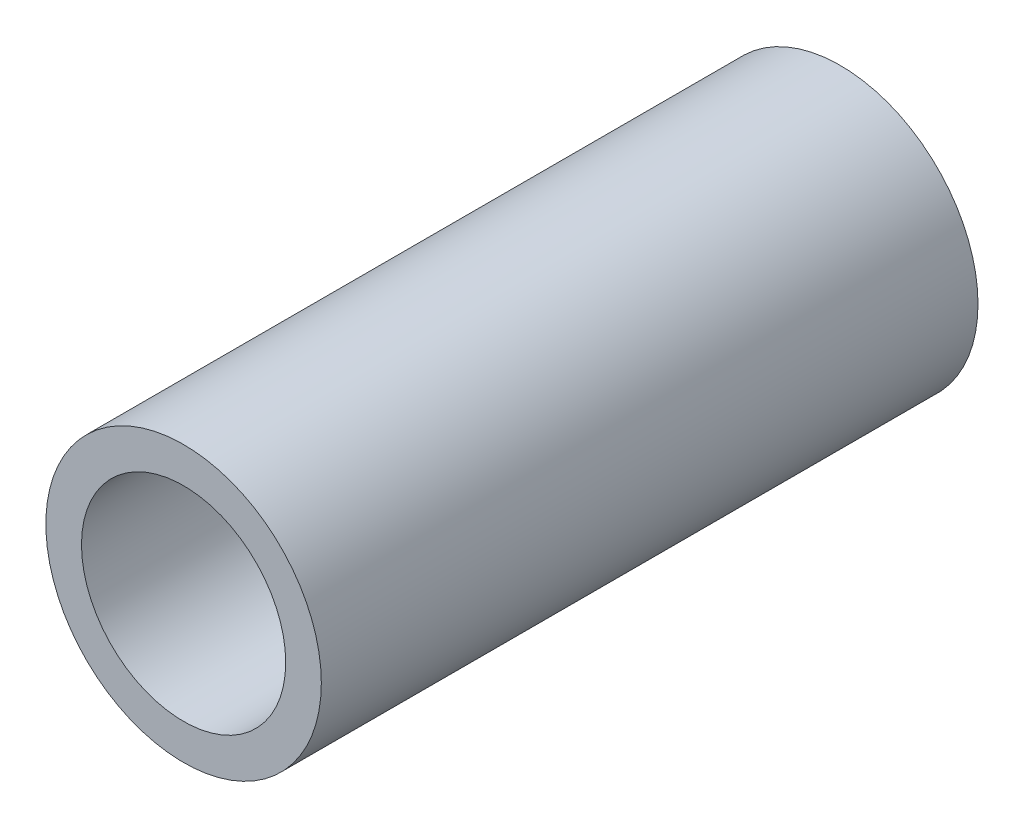
ISO-10303-21;
HEADER;
FILE_DESCRIPTION(('STEP AP214'),'2;1');
FILE_NAME('part.step','',(''),(''),'','','');
FILE_SCHEMA(('AUTOMOTIVE_DESIGN { 1 0 10303 214 1 1 1 1 }'));
ENDSEC;
DATA;
#1=APPLICATION_CONTEXT('core data for automotive mechanical design processes');
#2=APPLICATION_PROTOCOL_DEFINITION('international standard','automotive_design',2000,#1);
#3=PRODUCT_CONTEXT('',#1,'mechanical');
#4=PRODUCT('Part','Part','',(#3));
#5=PRODUCT_RELATED_PRODUCT_CATEGORY('part','',(#4));
#6=PRODUCT_DEFINITION_FORMATION('','',#4);
#7=PRODUCT_DEFINITION_CONTEXT('part definition',#1,'design');
#8=PRODUCT_DEFINITION('design','',#6,#7);
#9=PRODUCT_DEFINITION_SHAPE('','',#8);
#10=(LENGTH_UNIT() NAMED_UNIT(*) SI_UNIT(.MILLI.,.METRE.));
#11=(NAMED_UNIT(*) PLANE_ANGLE_UNIT() SI_UNIT($,.RADIAN.));
#12=(NAMED_UNIT(*) SI_UNIT($,.STERADIAN.) SOLID_ANGLE_UNIT());
#13=UNCERTAINTY_MEASURE_WITH_UNIT(LENGTH_MEASURE(1.E-05),#10,'distance_accuracy_value','');
#14=(GEOMETRIC_REPRESENTATION_CONTEXT(3) GLOBAL_UNCERTAINTY_ASSIGNED_CONTEXT((#13)) GLOBAL_UNIT_ASSIGNED_CONTEXT((#10,
#11,#12)) REPRESENTATION_CONTEXT('',''));
#15=CARTESIAN_POINT('',(0.,0.,0.));
#16=DIRECTION('',(0.,0.,1.));
#17=DIRECTION('',(1.,0.,0.));
#18=AXIS2_PLACEMENT_3D('',#15,#16,#17);
#19=CARTESIAN_POINT('',(0.,0.,50.8));
#20=DIRECTION('',(0.,0.,1.));
#21=DIRECTION('',(1.,0.,0.));
#22=AXIS2_PLACEMENT_3D('',#19,#20,#21);
#23=PLANE('',#22);
#24=CARTESIAN_POINT('',(0.,0.,50.8));
#25=DIRECTION('',(0.,0.,1.));
#26=DIRECTION('',(1.,0.,0.));
#27=AXIS2_PLACEMENT_3D('',#24,#25,#26);
#28=CIRCLE('',#27,10.6553);
#29=CARTESIAN_POINT('',(10.6553,0.,50.8));
#30=VERTEX_POINT('',#29);
#31=EDGE_CURVE('E10',#30,#30,#28,.T.);
#32=ORIENTED_EDGE('',*,*,#31,.T.);
#33=EDGE_LOOP('',(#32));
#34=FACE_BOUND('',#33,.T.);
#35=CARTESIAN_POINT('',(0.,0.,50.8));
#36=DIRECTION('',(0.,0.,1.));
#37=DIRECTION('',(1.,0.,0.));
#38=AXIS2_PLACEMENT_3D('',#35,#36,#37);
#39=CIRCLE('',#38,7.8994);
#40=CARTESIAN_POINT('',(7.8994,0.,50.8));
#41=VERTEX_POINT('',#40);
#42=EDGE_CURVE('E41',#41,#41,#39,.T.);
#43=ORIENTED_EDGE('',*,*,#42,.F.);
#44=EDGE_LOOP('',(#43));
#45=FACE_BOUND('',#44,.T.);
#46=ADVANCED_FACE('F30',(#34,#45),#23,.T.);
#47=CARTESIAN_POINT('',(0.,0.,0.));
#48=DIRECTION('',(0.,0.,1.));
#49=DIRECTION('',(1.,0.,0.));
#50=AXIS2_PLACEMENT_3D('',#47,#48,#49);
#51=PLANE('',#50);
#52=CARTESIAN_POINT('',(0.,0.,0.));
#53=DIRECTION('',(0.,0.,1.));
#54=DIRECTION('',(1.,0.,0.));
#55=AXIS2_PLACEMENT_3D('',#52,#53,#54);
#56=CIRCLE('',#55,10.6553);
#57=CARTESIAN_POINT('',(10.6553,0.,0.));
#58=VERTEX_POINT('',#57);
#59=EDGE_CURVE('E34',#58,#58,#56,.T.);
#60=ORIENTED_EDGE('',*,*,#59,.F.);
#61=EDGE_LOOP('',(#60));
#62=FACE_BOUND('',#61,.T.);
#63=CARTESIAN_POINT('',(0.,0.,0.));
#64=DIRECTION('',(0.,0.,1.));
#65=DIRECTION('',(1.,0.,0.));
#66=AXIS2_PLACEMENT_3D('',#63,#64,#65);
#67=CIRCLE('',#66,7.8994);
#68=CARTESIAN_POINT('',(7.8994,0.,0.));
#69=VERTEX_POINT('',#68);
#70=EDGE_CURVE('E43',#69,#69,#67,.T.);
#71=ORIENTED_EDGE('',*,*,#70,.T.);
#72=EDGE_LOOP('',(#71));
#73=FACE_BOUND('',#72,.T.);
#74=ADVANCED_FACE('F53',(#62,#73),#51,.F.);
#75=CARTESIAN_POINT('',(0.,0.,50.8));
#76=DIRECTION('',(0.,0.,-1.));
#77=DIRECTION('',(-1.,0.,0.));
#78=AXIS2_PLACEMENT_3D('',#75,#76,#77);
#79=CYLINDRICAL_SURFACE('',#78,10.6553);
#80=ORIENTED_EDGE('',*,*,#31,.F.);
#81=EDGE_LOOP('',(#80));
#82=FACE_BOUND('',#81,.T.);
#83=ORIENTED_EDGE('',*,*,#59,.T.);
#84=EDGE_LOOP('',(#83));
#85=FACE_BOUND('',#84,.T.);
#86=ADVANCED_FACE('F32',(#82,#85),#79,.T.);
#87=CARTESIAN_POINT('',(0.,0.,50.8));
#88=DIRECTION('',(0.,0.,-1.));
#89=DIRECTION('',(-1.,0.,0.));
#90=AXIS2_PLACEMENT_3D('',#87,#88,#89);
#91=CYLINDRICAL_SURFACE('',#90,7.8994);
#92=ORIENTED_EDGE('',*,*,#42,.T.);
#93=EDGE_LOOP('',(#92));
#94=FACE_BOUND('',#93,.T.);
#95=ORIENTED_EDGE('',*,*,#70,.F.);
#96=EDGE_LOOP('',(#95));
#97=FACE_BOUND('',#96,.T.);
#98=ADVANCED_FACE('F49',(#94,#97),#91,.F.);
#99=CLOSED_SHELL('',(#46,#74,#86,#98));
#100=MANIFOLD_SOLID_BREP('B2',#99);
#101=ADVANCED_BREP_SHAPE_REPRESENTATION('',(#18,#100),#14);
#102=SHAPE_DEFINITION_REPRESENTATION(#9,#101);
ENDSEC;
END-ISO-10303-21;
